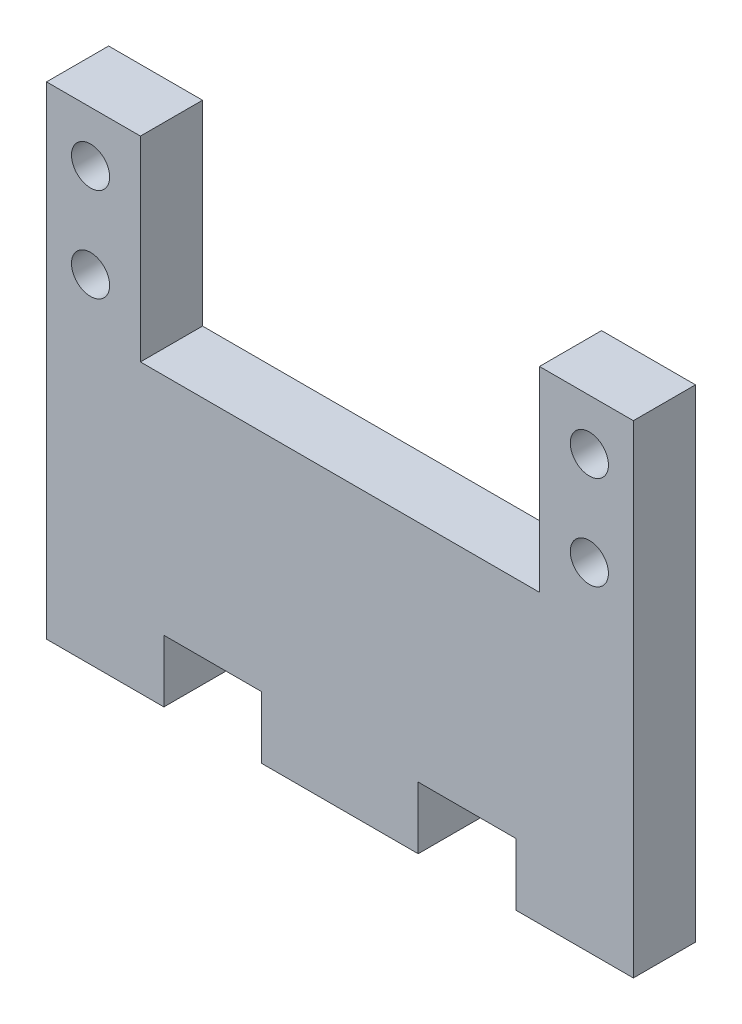
ISO-10303-21;
HEADER;
FILE_DESCRIPTION(('STEP AP214'),'2;1');
FILE_NAME('part.step','',(''),(''),'','','');
FILE_SCHEMA(('AUTOMOTIVE_DESIGN { 1 0 10303 214 1 1 1 1 }'));
ENDSEC;
DATA;
#1=APPLICATION_CONTEXT('core data for automotive mechanical design processes');
#2=APPLICATION_PROTOCOL_DEFINITION('international standard','automotive_design',2000,#1);
#3=PRODUCT_CONTEXT('',#1,'mechanical');
#4=PRODUCT('Part','Part','',(#3));
#5=PRODUCT_RELATED_PRODUCT_CATEGORY('part','',(#4));
#6=PRODUCT_DEFINITION_FORMATION('','',#4);
#7=PRODUCT_DEFINITION_CONTEXT('part definition',#1,'design');
#8=PRODUCT_DEFINITION('design','',#6,#7);
#9=PRODUCT_DEFINITION_SHAPE('','',#8);
#10=(LENGTH_UNIT() NAMED_UNIT(*) SI_UNIT(.MILLI.,.METRE.));
#11=(NAMED_UNIT(*) PLANE_ANGLE_UNIT() SI_UNIT($,.RADIAN.));
#12=(NAMED_UNIT(*) SI_UNIT($,.STERADIAN.) SOLID_ANGLE_UNIT());
#13=UNCERTAINTY_MEASURE_WITH_UNIT(LENGTH_MEASURE(1.E-05),#10,'distance_accuracy_value','');
#14=(GEOMETRIC_REPRESENTATION_CONTEXT(3) GLOBAL_UNCERTAINTY_ASSIGNED_CONTEXT((#13)) GLOBAL_UNIT_ASSIGNED_CONTEXT((#10,
#11,#12)) REPRESENTATION_CONTEXT('',''));
#15=CARTESIAN_POINT('',(0.,0.,0.));
#16=DIRECTION('',(0.,0.,1.));
#17=DIRECTION('',(1.,0.,0.));
#18=AXIS2_PLACEMENT_3D('',#15,#16,#17);
#19=CARTESIAN_POINT('',(-30.,21.5,6.35));
#20=DIRECTION('',(0.,-1.,0.));
#21=DIRECTION('',(0.,0.,-1.));
#22=AXIS2_PLACEMENT_3D('',#19,#20,#21);
#23=PLANE('',#22);
#24=DIRECTION('',(-1.,0.,0.));
#25=VECTOR('',#24,1.);
#26=CARTESIAN_POINT('',(-30.,21.5,6.35));
#27=LINE('',#26,#25);
#28=CARTESIAN_POINT('',(-20.4,21.5,6.35));
#29=VERTEX_POINT('',#28);
#30=CARTESIAN_POINT('',(-30.,21.5,6.35));
#31=VERTEX_POINT('',#30);
#32=EDGE_CURVE('E227',#29,#31,#27,.T.);
#33=ORIENTED_EDGE('',*,*,#32,.F.);
#34=DIRECTION('',(0.,0.,1.));
#35=VECTOR('',#34,1.);
#36=CARTESIAN_POINT('',(-20.4,21.5,-45.4383098277214));
#37=LINE('',#36,#35);
#38=CARTESIAN_POINT('',(-20.4,21.5,0.));
#39=VERTEX_POINT('',#38);
#40=EDGE_CURVE('E231',#39,#29,#37,.T.);
#41=ORIENTED_EDGE('',*,*,#40,.F.);
#42=DIRECTION('',(-1.,0.,0.));
#43=VECTOR('',#42,1.);
#44=CARTESIAN_POINT('',(-30.,21.5,0.));
#45=LINE('',#44,#43);
#46=CARTESIAN_POINT('',(-30.,21.5,0.));
#47=VERTEX_POINT('',#46);
#48=EDGE_CURVE('E175',#39,#47,#45,.T.);
#49=ORIENTED_EDGE('',*,*,#48,.T.);
#50=DIRECTION('',(0.,0.,-1.));
#51=VECTOR('',#50,1.);
#52=CARTESIAN_POINT('',(-30.,21.5,6.35));
#53=LINE('',#52,#51);
#54=EDGE_CURVE('E41',#31,#47,#53,.T.);
#55=ORIENTED_EDGE('',*,*,#54,.F.);
#56=EDGE_LOOP('',(#33,#41,#49,#55));
#57=FACE_BOUND('',#56,.T.);
#58=ADVANCED_FACE('F33',(#57),#23,.F.);
#59=CARTESIAN_POINT('',(30.,21.5,0.));
#60=VERTEX_POINT('',#59);
#61=CARTESIAN_POINT('',(20.4,21.5,0.));
#62=VERTEX_POINT('',#61);
#63=EDGE_CURVE('E171',#60,#62,#45,.T.);
#64=ORIENTED_EDGE('',*,*,#63,.T.);
#65=DIRECTION('',(0.,0.,1.));
#66=VECTOR('',#65,1.);
#67=CARTESIAN_POINT('',(20.4,21.5,-45.4383098277214));
#68=LINE('',#67,#66);
#69=CARTESIAN_POINT('',(20.4,21.5,6.35));
#70=VERTEX_POINT('',#69);
#71=EDGE_CURVE('E48',#62,#70,#68,.T.);
#72=ORIENTED_EDGE('',*,*,#71,.T.);
#73=CARTESIAN_POINT('',(30.,21.5,6.35));
#74=VERTEX_POINT('',#73);
#75=EDGE_CURVE('E110',#74,#70,#27,.T.);
#76=ORIENTED_EDGE('',*,*,#75,.F.);
#77=DIRECTION('',(0.,0.,-1.));
#78=VECTOR('',#77,1.);
#79=CARTESIAN_POINT('',(30.,21.5,6.35));
#80=LINE('',#79,#78);
#81=EDGE_CURVE('E11',#74,#60,#80,.T.);
#82=ORIENTED_EDGE('',*,*,#81,.T.);
#83=EDGE_LOOP('',(#64,#72,#76,#82));
#84=FACE_BOUND('',#83,.T.);
#85=ADVANCED_FACE('F35',(#84),#23,.F.);
#86=CARTESIAN_POINT('',(-30.,-21.5,6.35));
#87=DIRECTION('',(1.,0.,0.));
#88=DIRECTION('',(0.,0.,-1.));
#89=AXIS2_PLACEMENT_3D('',#86,#87,#88);
#90=PLANE('',#89);
#91=DIRECTION('',(0.,-1.,0.));
#92=VECTOR('',#91,1.);
#93=CARTESIAN_POINT('',(-30.,-21.5,0.));
#94=LINE('',#93,#92);
#95=CARTESIAN_POINT('',(-30.,-27.85,0.));
#96=VERTEX_POINT('',#95);
#97=EDGE_CURVE('E174',#47,#96,#94,.T.);
#98=ORIENTED_EDGE('',*,*,#97,.T.);
#99=DIRECTION('',(0.,0.,-1.));
#100=VECTOR('',#99,1.);
#101=CARTESIAN_POINT('',(-30.,-27.85,6.35));
#102=LINE('',#101,#100);
#103=CARTESIAN_POINT('',(-30.,-27.85,6.35));
#104=VERTEX_POINT('',#103);
#105=EDGE_CURVE('E213',#104,#96,#102,.T.);
#106=ORIENTED_EDGE('',*,*,#105,.F.);
#107=DIRECTION('',(0.,-1.,0.));
#108=VECTOR('',#107,1.);
#109=CARTESIAN_POINT('',(-30.,-21.5,6.35));
#110=LINE('',#109,#108);
#111=EDGE_CURVE('E222',#31,#104,#110,.T.);
#112=ORIENTED_EDGE('',*,*,#111,.F.);
#113=ORIENTED_EDGE('',*,*,#54,.T.);
#114=EDGE_LOOP('',(#98,#106,#112,#113));
#115=FACE_BOUND('',#114,.T.);
#116=ADVANCED_FACE('F219',(#115),#90,.F.);
#117=CARTESIAN_POINT('',(-30.,-27.85,6.35));
#118=DIRECTION('',(0.,1.,0.));
#119=DIRECTION('',(0.,0.,1.));
#120=AXIS2_PLACEMENT_3D('',#117,#118,#119);
#121=PLANE('',#120);
#122=DIRECTION('',(1.,0.,0.));
#123=VECTOR('',#122,1.);
#124=CARTESIAN_POINT('',(-30.,-27.85,0.));
#125=LINE('',#124,#123);
#126=CARTESIAN_POINT('',(-18.,-27.85,0.));
#127=VERTEX_POINT('',#126);
#128=EDGE_CURVE('E177',#96,#127,#125,.T.);
#129=ORIENTED_EDGE('',*,*,#128,.T.);
#130=DIRECTION('',(0.,0.,-1.));
#131=VECTOR('',#130,1.);
#132=CARTESIAN_POINT('',(-18.,-27.85,6.35));
#133=LINE('',#132,#131);
#134=CARTESIAN_POINT('',(-18.,-27.85,6.35));
#135=VERTEX_POINT('',#134);
#136=EDGE_CURVE('E210',#135,#127,#133,.T.);
#137=ORIENTED_EDGE('',*,*,#136,.F.);
#138=DIRECTION('',(1.,0.,0.));
#139=VECTOR('',#138,1.);
#140=CARTESIAN_POINT('',(-30.,-27.85,6.35));
#141=LINE('',#140,#139);
#142=EDGE_CURVE('E249',#104,#135,#141,.T.);
#143=ORIENTED_EDGE('',*,*,#142,.F.);
#144=ORIENTED_EDGE('',*,*,#105,.T.);
#145=EDGE_LOOP('',(#129,#137,#143,#144));
#146=FACE_BOUND('',#145,.T.);
#147=ADVANCED_FACE('F240',(#146),#121,.F.);
#148=CARTESIAN_POINT('',(-18.,-27.85,6.35));
#149=DIRECTION('',(-1.,0.,0.));
#150=DIRECTION('',(0.,0.,1.));
#151=AXIS2_PLACEMENT_3D('',#148,#149,#150);
#152=PLANE('',#151);
#153=DIRECTION('',(0.,1.,0.));
#154=VECTOR('',#153,1.);
#155=CARTESIAN_POINT('',(-18.,-27.85,0.));
#156=LINE('',#155,#154);
#157=CARTESIAN_POINT('',(-18.,-21.5,0.));
#158=VERTEX_POINT('',#157);
#159=EDGE_CURVE('E179',#127,#158,#156,.T.);
#160=ORIENTED_EDGE('',*,*,#159,.T.);
#161=DIRECTION('',(0.,0.,-1.));
#162=VECTOR('',#161,1.);
#163=CARTESIAN_POINT('',(-18.,-21.5,6.35));
#164=LINE('',#163,#162);
#165=CARTESIAN_POINT('',(-18.,-21.5,6.35));
#166=VERTEX_POINT('',#165);
#167=EDGE_CURVE('E207',#166,#158,#164,.T.);
#168=ORIENTED_EDGE('',*,*,#167,.F.);
#169=DIRECTION('',(0.,1.,0.));
#170=VECTOR('',#169,1.);
#171=CARTESIAN_POINT('',(-18.,-27.85,6.35));
#172=LINE('',#171,#170);
#173=EDGE_CURVE('E246',#135,#166,#172,.T.);
#174=ORIENTED_EDGE('',*,*,#173,.F.);
#175=ORIENTED_EDGE('',*,*,#136,.T.);
#176=EDGE_LOOP('',(#160,#168,#174,#175));
#177=FACE_BOUND('',#176,.T.);
#178=ADVANCED_FACE('F244',(#177),#152,.F.);
#179=CARTESIAN_POINT('',(-18.,-21.5,6.35));
#180=DIRECTION('',(0.,1.,0.));
#181=DIRECTION('',(0.,0.,1.));
#182=AXIS2_PLACEMENT_3D('',#179,#180,#181);
#183=PLANE('',#182);
#184=DIRECTION('',(1.,0.,0.));
#185=VECTOR('',#184,1.);
#186=CARTESIAN_POINT('',(-18.,-21.5,0.));
#187=LINE('',#186,#185);
#188=CARTESIAN_POINT('',(-7.99999999999998,-21.5,0.));
#189=VERTEX_POINT('',#188);
#190=EDGE_CURVE('E181',#158,#189,#187,.T.);
#191=ORIENTED_EDGE('',*,*,#190,.T.);
#192=DIRECTION('',(0.,0.,-1.));
#193=VECTOR('',#192,1.);
#194=CARTESIAN_POINT('',(-7.99999999999998,-21.5,6.35));
#195=LINE('',#194,#193);
#196=CARTESIAN_POINT('',(-7.99999999999998,-21.5,6.35));
#197=VERTEX_POINT('',#196);
#198=EDGE_CURVE('E204',#197,#189,#195,.T.);
#199=ORIENTED_EDGE('',*,*,#198,.F.);
#200=DIRECTION('',(1.,0.,0.));
#201=VECTOR('',#200,1.);
#202=CARTESIAN_POINT('',(-18.,-21.5,6.35));
#203=LINE('',#202,#201);
#204=EDGE_CURVE('E248',#166,#197,#203,.T.);
#205=ORIENTED_EDGE('',*,*,#204,.F.);
#206=ORIENTED_EDGE('',*,*,#167,.T.);
#207=EDGE_LOOP('',(#191,#199,#205,#206));
#208=FACE_BOUND('',#207,.T.);
#209=ADVANCED_FACE('F377',(#208),#183,.F.);
#210=CARTESIAN_POINT('',(-7.99999999999998,-21.5,6.35));
#211=DIRECTION('',(1.,0.,0.));
#212=DIRECTION('',(0.,1.,0.));
#213=AXIS2_PLACEMENT_3D('',#210,#211,#212);
#214=PLANE('',#213);
#215=DIRECTION('',(0.,-1.,0.));
#216=VECTOR('',#215,1.);
#217=CARTESIAN_POINT('',(-7.99999999999998,-21.5,0.));
#218=LINE('',#217,#216);
#219=CARTESIAN_POINT('',(-7.99999999999998,-27.85,0.));
#220=VERTEX_POINT('',#219);
#221=EDGE_CURVE('E183',#189,#220,#218,.T.);
#222=ORIENTED_EDGE('',*,*,#221,.T.);
#223=DIRECTION('',(0.,0.,-1.));
#224=VECTOR('',#223,1.);
#225=CARTESIAN_POINT('',(-7.99999999999998,-27.85,6.35));
#226=LINE('',#225,#224);
#227=CARTESIAN_POINT('',(-7.99999999999998,-27.85,6.35));
#228=VERTEX_POINT('',#227);
#229=EDGE_CURVE('E201',#228,#220,#226,.T.);
#230=ORIENTED_EDGE('',*,*,#229,.F.);
#231=DIRECTION('',(0.,-1.,0.));
#232=VECTOR('',#231,1.);
#233=CARTESIAN_POINT('',(-7.99999999999998,-21.5,6.35));
#234=LINE('',#233,#232);
#235=EDGE_CURVE('E251',#197,#228,#234,.T.);
#236=ORIENTED_EDGE('',*,*,#235,.F.);
#237=ORIENTED_EDGE('',*,*,#198,.T.);
#238=EDGE_LOOP('',(#222,#230,#236,#237));
#239=FACE_BOUND('',#238,.T.);
#240=ADVANCED_FACE('F380',(#239),#214,.F.);
#241=CARTESIAN_POINT('',(-7.99999999999998,-27.85,6.35));
#242=DIRECTION('',(0.,1.,0.));
#243=DIRECTION('',(0.,0.,1.));
#244=AXIS2_PLACEMENT_3D('',#241,#242,#243);
#245=PLANE('',#244);
#246=DIRECTION('',(1.,0.,0.));
#247=VECTOR('',#246,1.);
#248=CARTESIAN_POINT('',(-7.99999999999998,-27.85,0.));
#249=LINE('',#248,#247);
#250=CARTESIAN_POINT('',(7.99999999999998,-27.85,0.));
#251=VERTEX_POINT('',#250);
#252=EDGE_CURVE('E185',#220,#251,#249,.T.);
#253=ORIENTED_EDGE('',*,*,#252,.T.);
#254=DIRECTION('',(0.,0.,-1.));
#255=VECTOR('',#254,1.);
#256=CARTESIAN_POINT('',(7.99999999999998,-27.85,6.35));
#257=LINE('',#256,#255);
#258=CARTESIAN_POINT('',(7.99999999999998,-27.85,6.35));
#259=VERTEX_POINT('',#258);
#260=EDGE_CURVE('E198',#259,#251,#257,.T.);
#261=ORIENTED_EDGE('',*,*,#260,.F.);
#262=DIRECTION('',(1.,0.,0.));
#263=VECTOR('',#262,1.);
#264=CARTESIAN_POINT('',(-7.99999999999998,-27.85,6.35));
#265=LINE('',#264,#263);
#266=EDGE_CURVE('E257',#228,#259,#265,.T.);
#267=ORIENTED_EDGE('',*,*,#266,.F.);
#268=ORIENTED_EDGE('',*,*,#229,.T.);
#269=EDGE_LOOP('',(#253,#261,#267,#268));
#270=FACE_BOUND('',#269,.T.);
#271=ADVANCED_FACE('F263',(#270),#245,.F.);
#272=CARTESIAN_POINT('',(7.99999999999998,-21.5,6.35));
#273=DIRECTION('',(-1.,0.,0.));
#274=DIRECTION('',(0.,-1.,0.));
#275=AXIS2_PLACEMENT_3D('',#272,#273,#274);
#276=PLANE('',#275);
#277=DIRECTION('',(0.,1.,0.));
#278=VECTOR('',#277,1.);
#279=CARTESIAN_POINT('',(7.99999999999998,-21.5,0.));
#280=LINE('',#279,#278);
#281=CARTESIAN_POINT('',(7.99999999999998,-21.5,0.));
#282=VERTEX_POINT('',#281);
#283=EDGE_CURVE('E187',#251,#282,#280,.T.);
#284=ORIENTED_EDGE('',*,*,#283,.T.);
#285=DIRECTION('',(0.,0.,-1.));
#286=VECTOR('',#285,1.);
#287=CARTESIAN_POINT('',(7.99999999999998,-21.5,6.35));
#288=LINE('',#287,#286);
#289=CARTESIAN_POINT('',(7.99999999999998,-21.5,6.35));
#290=VERTEX_POINT('',#289);
#291=EDGE_CURVE('E160',#290,#282,#288,.T.);
#292=ORIENTED_EDGE('',*,*,#291,.F.);
#293=DIRECTION('',(0.,1.,0.));
#294=VECTOR('',#293,1.);
#295=CARTESIAN_POINT('',(7.99999999999998,-21.5,6.35));
#296=LINE('',#295,#294);
#297=EDGE_CURVE('E148',#259,#290,#296,.T.);
#298=ORIENTED_EDGE('',*,*,#297,.F.);
#299=ORIENTED_EDGE('',*,*,#260,.T.);
#300=EDGE_LOOP('',(#284,#292,#298,#299));
#301=FACE_BOUND('',#300,.T.);
#302=ADVANCED_FACE('F267',(#301),#276,.F.);
#303=CARTESIAN_POINT('',(18.,-21.5,6.35));
#304=DIRECTION('',(0.,1.,0.));
#305=DIRECTION('',(-1.,0.,0.));
#306=AXIS2_PLACEMENT_3D('',#303,#304,#305);
#307=PLANE('',#306);
#308=DIRECTION('',(1.,0.,0.));
#309=VECTOR('',#308,1.);
#310=CARTESIAN_POINT('',(18.,-21.5,0.));
#311=LINE('',#310,#309);
#312=CARTESIAN_POINT('',(18.,-21.5,0.));
#313=VERTEX_POINT('',#312);
#314=EDGE_CURVE('E157',#282,#313,#311,.T.);
#315=ORIENTED_EDGE('',*,*,#314,.T.);
#316=DIRECTION('',(0.,0.,-1.));
#317=VECTOR('',#316,1.);
#318=CARTESIAN_POINT('',(18.,-21.5,6.35));
#319=LINE('',#318,#317);
#320=CARTESIAN_POINT('',(18.,-21.5,6.35));
#321=VERTEX_POINT('',#320);
#322=EDGE_CURVE('E154',#321,#313,#319,.T.);
#323=ORIENTED_EDGE('',*,*,#322,.F.);
#324=DIRECTION('',(1.,0.,0.));
#325=VECTOR('',#324,1.);
#326=CARTESIAN_POINT('',(18.,-21.5,6.35));
#327=LINE('',#326,#325);
#328=EDGE_CURVE('E140',#290,#321,#327,.T.);
#329=ORIENTED_EDGE('',*,*,#328,.F.);
#330=ORIENTED_EDGE('',*,*,#291,.T.);
#331=EDGE_LOOP('',(#315,#323,#329,#330));
#332=FACE_BOUND('',#331,.T.);
#333=ADVANCED_FACE('F155',(#332),#307,.F.);
#334=CARTESIAN_POINT('',(18.,-27.85,6.35));
#335=DIRECTION('',(1.,0.,0.));
#336=DIRECTION('',(0.,1.,0.));
#337=AXIS2_PLACEMENT_3D('',#334,#335,#336);
#338=PLANE('',#337);
#339=DIRECTION('',(0.,-1.,0.));
#340=VECTOR('',#339,1.);
#341=CARTESIAN_POINT('',(18.,-27.85,0.));
#342=LINE('',#341,#340);
#343=CARTESIAN_POINT('',(18.,-27.85,0.));
#344=VERTEX_POINT('',#343);
#345=EDGE_CURVE('E190',#313,#344,#342,.T.);
#346=ORIENTED_EDGE('',*,*,#345,.T.);
#347=DIRECTION('',(0.,0.,-1.));
#348=VECTOR('',#347,1.);
#349=CARTESIAN_POINT('',(18.,-27.85,6.35));
#350=LINE('',#349,#348);
#351=CARTESIAN_POINT('',(18.,-27.85,6.35));
#352=VERTEX_POINT('',#351);
#353=EDGE_CURVE('E161',#352,#344,#350,.T.);
#354=ORIENTED_EDGE('',*,*,#353,.F.);
#355=DIRECTION('',(0.,-1.,0.));
#356=VECTOR('',#355,1.);
#357=CARTESIAN_POINT('',(18.,-27.85,6.35));
#358=LINE('',#357,#356);
#359=EDGE_CURVE('E145',#321,#352,#358,.T.);
#360=ORIENTED_EDGE('',*,*,#359,.F.);
#361=ORIENTED_EDGE('',*,*,#322,.T.);
#362=EDGE_LOOP('',(#346,#354,#360,#361));
#363=FACE_BOUND('',#362,.T.);
#364=ADVANCED_FACE('F163',(#363),#338,.F.);
#365=CARTESIAN_POINT('',(30.,-27.85,6.35));
#366=DIRECTION('',(0.,1.,0.));
#367=DIRECTION('',(-1.,0.,0.));
#368=AXIS2_PLACEMENT_3D('',#365,#366,#367);
#369=PLANE('',#368);
#370=DIRECTION('',(1.,0.,0.));
#371=VECTOR('',#370,1.);
#372=CARTESIAN_POINT('',(30.,-27.85,0.));
#373=LINE('',#372,#371);
#374=CARTESIAN_POINT('',(30.,-27.85,0.));
#375=VERTEX_POINT('',#374);
#376=EDGE_CURVE('E104',#344,#375,#373,.T.);
#377=ORIENTED_EDGE('',*,*,#376,.T.);
#378=DIRECTION('',(0.,0.,-1.));
#379=VECTOR('',#378,1.);
#380=CARTESIAN_POINT('',(30.,-27.85,6.35));
#381=LINE('',#380,#379);
#382=CARTESIAN_POINT('',(30.,-27.85,6.35));
#383=VERTEX_POINT('',#382);
#384=EDGE_CURVE('E167',#383,#375,#381,.T.);
#385=ORIENTED_EDGE('',*,*,#384,.F.);
#386=DIRECTION('',(1.,0.,0.));
#387=VECTOR('',#386,1.);
#388=CARTESIAN_POINT('',(30.,-27.85,6.35));
#389=LINE('',#388,#387);
#390=EDGE_CURVE('E165',#352,#383,#389,.T.);
#391=ORIENTED_EDGE('',*,*,#390,.F.);
#392=ORIENTED_EDGE('',*,*,#353,.T.);
#393=EDGE_LOOP('',(#377,#385,#391,#392));
#394=FACE_BOUND('',#393,.T.);
#395=ADVANCED_FACE('F269',(#394),#369,.F.);
#396=CARTESIAN_POINT('',(30.,-21.5,6.35));
#397=DIRECTION('',(-1.,0.,0.));
#398=DIRECTION('',(0.,-1.,0.));
#399=AXIS2_PLACEMENT_3D('',#396,#397,#398);
#400=PLANE('',#399);
#401=DIRECTION('',(0.,1.,0.));
#402=VECTOR('',#401,1.);
#403=CARTESIAN_POINT('',(30.,-21.5,0.));
#404=LINE('',#403,#402);
#405=EDGE_CURVE('E193',#375,#60,#404,.T.);
#406=ORIENTED_EDGE('',*,*,#405,.T.);
#407=ORIENTED_EDGE('',*,*,#81,.F.);
#408=DIRECTION('',(0.,1.,0.));
#409=VECTOR('',#408,1.);
#410=CARTESIAN_POINT('',(30.,-21.5,6.35));
#411=LINE('',#410,#409);
#412=EDGE_CURVE('E57',#383,#74,#411,.T.);
#413=ORIENTED_EDGE('',*,*,#412,.F.);
#414=ORIENTED_EDGE('',*,*,#384,.T.);
#415=EDGE_LOOP('',(#406,#407,#413,#414));
#416=FACE_BOUND('',#415,.T.);
#417=ADVANCED_FACE('F272',(#416),#400,.F.);
#418=CARTESIAN_POINT('',(30.,21.5,6.35));
#419=DIRECTION('',(0.,0.,-1.));
#420=DIRECTION('',(-1.,0.,0.));
#421=AXIS2_PLACEMENT_3D('',#418,#419,#420);
#422=PLANE('',#421);
#423=CARTESIAN_POINT('',(25.5,16.3,6.35));
#424=DIRECTION('',(0.,0.,1.));
#425=DIRECTION('',(1.,0.,0.));
#426=AXIS2_PLACEMENT_3D('',#423,#424,#425);
#427=CIRCLE('',#426,1.95);
#428=CARTESIAN_POINT('',(27.45,16.3,6.35));
#429=VERTEX_POINT('',#428);
#430=EDGE_CURVE('E328',#429,#429,#427,.T.);
#431=ORIENTED_EDGE('',*,*,#430,.F.);
#432=EDGE_LOOP('',(#431));
#433=FACE_BOUND('',#432,.T.);
#434=CARTESIAN_POINT('',(25.5,6.69999999999997,6.35));
#435=DIRECTION('',(0.,0.,1.));
#436=DIRECTION('',(-1.,0.,0.));
#437=AXIS2_PLACEMENT_3D('',#434,#435,#436);
#438=CIRCLE('',#437,1.95);
#439=CARTESIAN_POINT('',(23.55,6.69999999999997,6.35));
#440=VERTEX_POINT('',#439);
#441=EDGE_CURVE('E322',#440,#440,#438,.T.);
#442=ORIENTED_EDGE('',*,*,#441,.F.);
#443=EDGE_LOOP('',(#442));
#444=FACE_BOUND('',#443,.T.);
#445=CARTESIAN_POINT('',(-25.5,6.7,6.35));
#446=DIRECTION('',(0.,0.,1.));
#447=DIRECTION('',(1.,0.,0.));
#448=AXIS2_PLACEMENT_3D('',#445,#446,#447);
#449=CIRCLE('',#448,1.95);
#450=CARTESIAN_POINT('',(-23.55,6.7,6.35));
#451=VERTEX_POINT('',#450);
#452=EDGE_CURVE('E316',#451,#451,#449,.T.);
#453=ORIENTED_EDGE('',*,*,#452,.F.);
#454=EDGE_LOOP('',(#453));
#455=FACE_BOUND('',#454,.T.);
#456=CARTESIAN_POINT('',(-25.5,16.3,6.35));
#457=DIRECTION('',(0.,0.,1.));
#458=DIRECTION('',(-1.,0.,0.));
#459=AXIS2_PLACEMENT_3D('',#456,#457,#458);
#460=CIRCLE('',#459,1.95);
#461=CARTESIAN_POINT('',(-27.45,16.3,6.35));
#462=VERTEX_POINT('',#461);
#463=EDGE_CURVE('E310',#462,#462,#460,.T.);
#464=ORIENTED_EDGE('',*,*,#463,.F.);
#465=EDGE_LOOP('',(#464));
#466=FACE_BOUND('',#465,.T.);
#467=DIRECTION('',(1.,0.,0.));
#468=VECTOR('',#467,1.);
#469=CARTESIAN_POINT('',(-20.4,1.5,6.35));
#470=LINE('',#469,#468);
#471=CARTESIAN_POINT('',(-20.4,1.5,6.35));
#472=VERTEX_POINT('',#471);
#473=CARTESIAN_POINT('',(20.4,1.5,6.35));
#474=VERTEX_POINT('',#473);
#475=EDGE_CURVE('E295',#472,#474,#470,.T.);
#476=ORIENTED_EDGE('',*,*,#475,.F.);
#477=DIRECTION('',(0.,-1.,0.));
#478=VECTOR('',#477,1.);
#479=CARTESIAN_POINT('',(-20.4,1.5,6.35));
#480=LINE('',#479,#478);
#481=EDGE_CURVE('E299',#29,#472,#480,.T.);
#482=ORIENTED_EDGE('',*,*,#481,.F.);
#483=ORIENTED_EDGE('',*,*,#32,.T.);
#484=ORIENTED_EDGE('',*,*,#111,.T.);
#485=ORIENTED_EDGE('',*,*,#142,.T.);
#486=ORIENTED_EDGE('',*,*,#173,.T.);
#487=ORIENTED_EDGE('',*,*,#204,.T.);
#488=ORIENTED_EDGE('',*,*,#235,.T.);
#489=ORIENTED_EDGE('',*,*,#266,.T.);
#490=ORIENTED_EDGE('',*,*,#297,.T.);
#491=ORIENTED_EDGE('',*,*,#328,.T.);
#492=ORIENTED_EDGE('',*,*,#359,.T.);
#493=ORIENTED_EDGE('',*,*,#390,.T.);
#494=ORIENTED_EDGE('',*,*,#412,.T.);
#495=ORIENTED_EDGE('',*,*,#75,.T.);
#496=DIRECTION('',(0.,1.,0.));
#497=VECTOR('',#496,1.);
#498=CARTESIAN_POINT('',(20.4,1.5,6.35));
#499=LINE('',#498,#497);
#500=EDGE_CURVE('E287',#474,#70,#499,.T.);
#501=ORIENTED_EDGE('',*,*,#500,.F.);
#502=EDGE_LOOP('',(#476,#482,#483,#484,#485,#486,#487,#488,#489,#490,#491,#492,#493,#494,#495,#501));
#503=FACE_BOUND('',#502,.T.);
#504=ADVANCED_FACE('F143',(#433,#444,#455,#466,#503),#422,.F.);
#505=CARTESIAN_POINT('',(30.,21.5,0.));
#506=DIRECTION('',(0.,0.,-1.));
#507=DIRECTION('',(-1.,0.,0.));
#508=AXIS2_PLACEMENT_3D('',#505,#506,#507);
#509=PLANE('',#508);
#510=CARTESIAN_POINT('',(25.5,16.3,0.));
#511=DIRECTION('',(0.,0.,-1.));
#512=DIRECTION('',(-1.,0.,0.));
#513=AXIS2_PLACEMENT_3D('',#510,#511,#512);
#514=CIRCLE('',#513,1.95);
#515=CARTESIAN_POINT('',(23.55,16.3,0.));
#516=VERTEX_POINT('',#515);
#517=EDGE_CURVE('E325',#516,#516,#514,.F.);
#518=ORIENTED_EDGE('',*,*,#517,.T.);
#519=EDGE_LOOP('',(#518));
#520=FACE_BOUND('',#519,.T.);
#521=CARTESIAN_POINT('',(25.5,6.69999999999997,0.));
#522=DIRECTION('',(0.,0.,-1.));
#523=DIRECTION('',(-1.,0.,0.));
#524=AXIS2_PLACEMENT_3D('',#521,#522,#523);
#525=CIRCLE('',#524,1.95);
#526=CARTESIAN_POINT('',(23.55,6.69999999999997,0.));
#527=VERTEX_POINT('',#526);
#528=EDGE_CURVE('E319',#527,#527,#525,.F.);
#529=ORIENTED_EDGE('',*,*,#528,.T.);
#530=EDGE_LOOP('',(#529));
#531=FACE_BOUND('',#530,.T.);
#532=CARTESIAN_POINT('',(-25.5,6.7,0.));
#533=DIRECTION('',(0.,0.,-1.));
#534=DIRECTION('',(-1.,0.,0.));
#535=AXIS2_PLACEMENT_3D('',#532,#533,#534);
#536=CIRCLE('',#535,1.95);
#537=CARTESIAN_POINT('',(-27.45,6.7,0.));
#538=VERTEX_POINT('',#537);
#539=EDGE_CURVE('E313',#538,#538,#536,.F.);
#540=ORIENTED_EDGE('',*,*,#539,.T.);
#541=EDGE_LOOP('',(#540));
#542=FACE_BOUND('',#541,.T.);
#543=CARTESIAN_POINT('',(-25.5,16.3,0.));
#544=DIRECTION('',(0.,0.,-1.));
#545=DIRECTION('',(-1.,0.,0.));
#546=AXIS2_PLACEMENT_3D('',#543,#544,#545);
#547=CIRCLE('',#546,1.95);
#548=CARTESIAN_POINT('',(-27.45,16.3,0.));
#549=VERTEX_POINT('',#548);
#550=EDGE_CURVE('E306',#549,#549,#547,.F.);
#551=ORIENTED_EDGE('',*,*,#550,.T.);
#552=EDGE_LOOP('',(#551));
#553=FACE_BOUND('',#552,.T.);
#554=DIRECTION('',(0.,-1.,0.));
#555=VECTOR('',#554,1.);
#556=CARTESIAN_POINT('',(-20.4,1.5,0.));
#557=LINE('',#556,#555);
#558=CARTESIAN_POINT('',(-20.4,1.5,0.));
#559=VERTEX_POINT('',#558);
#560=EDGE_CURVE('E291',#39,#559,#557,.T.);
#561=ORIENTED_EDGE('',*,*,#560,.T.);
#562=DIRECTION('',(1.,0.,0.));
#563=VECTOR('',#562,1.);
#564=CARTESIAN_POINT('',(-20.4,1.5,0.));
#565=LINE('',#564,#563);
#566=CARTESIAN_POINT('',(20.4,1.5,0.));
#567=VERTEX_POINT('',#566);
#568=EDGE_CURVE('E278',#559,#567,#565,.T.);
#569=ORIENTED_EDGE('',*,*,#568,.T.);
#570=DIRECTION('',(0.,1.,0.));
#571=VECTOR('',#570,1.);
#572=CARTESIAN_POINT('',(20.4,1.5,0.));
#573=LINE('',#572,#571);
#574=EDGE_CURVE('E275',#567,#62,#573,.T.);
#575=ORIENTED_EDGE('',*,*,#574,.T.);
#576=ORIENTED_EDGE('',*,*,#63,.F.);
#577=ORIENTED_EDGE('',*,*,#405,.F.);
#578=ORIENTED_EDGE('',*,*,#376,.F.);
#579=ORIENTED_EDGE('',*,*,#345,.F.);
#580=ORIENTED_EDGE('',*,*,#314,.F.);
#581=ORIENTED_EDGE('',*,*,#283,.F.);
#582=ORIENTED_EDGE('',*,*,#252,.F.);
#583=ORIENTED_EDGE('',*,*,#221,.F.);
#584=ORIENTED_EDGE('',*,*,#190,.F.);
#585=ORIENTED_EDGE('',*,*,#159,.F.);
#586=ORIENTED_EDGE('',*,*,#128,.F.);
#587=ORIENTED_EDGE('',*,*,#97,.F.);
#588=ORIENTED_EDGE('',*,*,#48,.F.);
#589=EDGE_LOOP('',(#561,#569,#575,#576,#577,#578,#579,#580,#581,#582,#583,#584,#585,#586,#587,#588));
#590=FACE_BOUND('',#589,.T.);
#591=ADVANCED_FACE('F235',(#520,#531,#542,#553,#590),#509,.T.);
#592=CARTESIAN_POINT('',(-20.4,1.5,-45.4383098277214));
#593=DIRECTION('',(-1.,0.,0.));
#594=DIRECTION('',(0.,0.,1.));
#595=AXIS2_PLACEMENT_3D('',#592,#593,#594);
#596=PLANE('',#595);
#597=ORIENTED_EDGE('',*,*,#40,.T.);
#598=ORIENTED_EDGE('',*,*,#481,.T.);
#599=DIRECTION('',(0.,0.,1.));
#600=VECTOR('',#599,1.);
#601=CARTESIAN_POINT('',(-20.4,1.5,-45.4383098277214));
#602=LINE('',#601,#600);
#603=EDGE_CURVE('E290',#559,#472,#602,.T.);
#604=ORIENTED_EDGE('',*,*,#603,.F.);
#605=ORIENTED_EDGE('',*,*,#560,.F.);
#606=EDGE_LOOP('',(#597,#598,#604,#605));
#607=FACE_BOUND('',#606,.T.);
#608=ADVANCED_FACE('F353',(#607),#596,.F.);
#609=CARTESIAN_POINT('',(-20.4,1.5,-45.4383098277214));
#610=DIRECTION('',(0.,-1.,0.));
#611=DIRECTION('',(0.,0.,-1.));
#612=AXIS2_PLACEMENT_3D('',#609,#610,#611);
#613=PLANE('',#612);
#614=ORIENTED_EDGE('',*,*,#603,.T.);
#615=ORIENTED_EDGE('',*,*,#475,.T.);
#616=DIRECTION('',(0.,0.,1.));
#617=VECTOR('',#616,1.);
#618=CARTESIAN_POINT('',(20.4,1.5,-45.4383098277214));
#619=LINE('',#618,#617);
#620=EDGE_CURVE('E281',#567,#474,#619,.T.);
#621=ORIENTED_EDGE('',*,*,#620,.F.);
#622=ORIENTED_EDGE('',*,*,#568,.F.);
#623=EDGE_LOOP('',(#614,#615,#621,#622));
#624=FACE_BOUND('',#623,.T.);
#625=ADVANCED_FACE('F359',(#624),#613,.F.);
#626=CARTESIAN_POINT('',(20.4,1.5,-45.4383098277214));
#627=DIRECTION('',(1.,0.,0.));
#628=DIRECTION('',(0.,0.,-1.));
#629=AXIS2_PLACEMENT_3D('',#626,#627,#628);
#630=PLANE('',#629);
#631=ORIENTED_EDGE('',*,*,#620,.T.);
#632=ORIENTED_EDGE('',*,*,#500,.T.);
#633=ORIENTED_EDGE('',*,*,#71,.F.);
#634=ORIENTED_EDGE('',*,*,#574,.F.);
#635=EDGE_LOOP('',(#631,#632,#633,#634));
#636=FACE_BOUND('',#635,.T.);
#637=ADVANCED_FACE('F348',(#636),#630,.F.);
#638=CARTESIAN_POINT('',(-25.5,16.3,-45.4383098277214));
#639=DIRECTION('',(0.,0.,1.));
#640=DIRECTION('',(1.,0.,0.));
#641=AXIS2_PLACEMENT_3D('',#638,#639,#640);
#642=CYLINDRICAL_SURFACE('',#641,1.95);
#643=ORIENTED_EDGE('',*,*,#463,.T.);
#644=EDGE_LOOP('',(#643));
#645=FACE_BOUND('',#644,.T.);
#646=ORIENTED_EDGE('',*,*,#550,.F.);
#647=EDGE_LOOP('',(#646));
#648=FACE_BOUND('',#647,.T.);
#649=ADVANCED_FACE('F344',(#645,#648),#642,.F.);
#650=CARTESIAN_POINT('',(-25.5,6.7,-45.4383098277214));
#651=DIRECTION('',(0.,0.,1.));
#652=DIRECTION('',(1.,0.,0.));
#653=AXIS2_PLACEMENT_3D('',#650,#651,#652);
#654=CYLINDRICAL_SURFACE('',#653,1.95);
#655=ORIENTED_EDGE('',*,*,#452,.T.);
#656=EDGE_LOOP('',(#655));
#657=FACE_BOUND('',#656,.T.);
#658=ORIENTED_EDGE('',*,*,#539,.F.);
#659=EDGE_LOOP('',(#658));
#660=FACE_BOUND('',#659,.T.);
#661=ADVANCED_FACE('F347',(#657,#660),#654,.F.);
#662=CARTESIAN_POINT('',(25.5,6.69999999999997,-45.4383098277214));
#663=DIRECTION('',(0.,0.,1.));
#664=DIRECTION('',(1.,0.,0.));
#665=AXIS2_PLACEMENT_3D('',#662,#663,#664);
#666=CYLINDRICAL_SURFACE('',#665,1.95);
#667=ORIENTED_EDGE('',*,*,#441,.T.);
#668=EDGE_LOOP('',(#667));
#669=FACE_BOUND('',#668,.T.);
#670=ORIENTED_EDGE('',*,*,#528,.F.);
#671=EDGE_LOOP('',(#670));
#672=FACE_BOUND('',#671,.T.);
#673=ADVANCED_FACE('F448',(#669,#672),#666,.F.);
#674=CARTESIAN_POINT('',(25.5,16.3,-45.4383098277214));
#675=DIRECTION('',(0.,0.,1.));
#676=DIRECTION('',(1.,0.,0.));
#677=AXIS2_PLACEMENT_3D('',#674,#675,#676);
#678=CYLINDRICAL_SURFACE('',#677,1.95);
#679=ORIENTED_EDGE('',*,*,#430,.T.);
#680=EDGE_LOOP('',(#679));
#681=FACE_BOUND('',#680,.T.);
#682=ORIENTED_EDGE('',*,*,#517,.F.);
#683=EDGE_LOOP('',(#682));
#684=FACE_BOUND('',#683,.T.);
#685=ADVANCED_FACE('F332',(#681,#684),#678,.F.);
#686=CLOSED_SHELL('',(#58,#85,#116,#147,#178,#209,#240,#271,#302,#333,#364,#395,#417,#504,#591,
#608,#625,#637,#649,#661,#673,#685));
#687=MANIFOLD_SOLID_BREP('B2',#686);
#688=ADVANCED_BREP_SHAPE_REPRESENTATION('',(#18,#687),#14);
#689=SHAPE_DEFINITION_REPRESENTATION(#9,#688);
ENDSEC;
END-ISO-10303-21;
